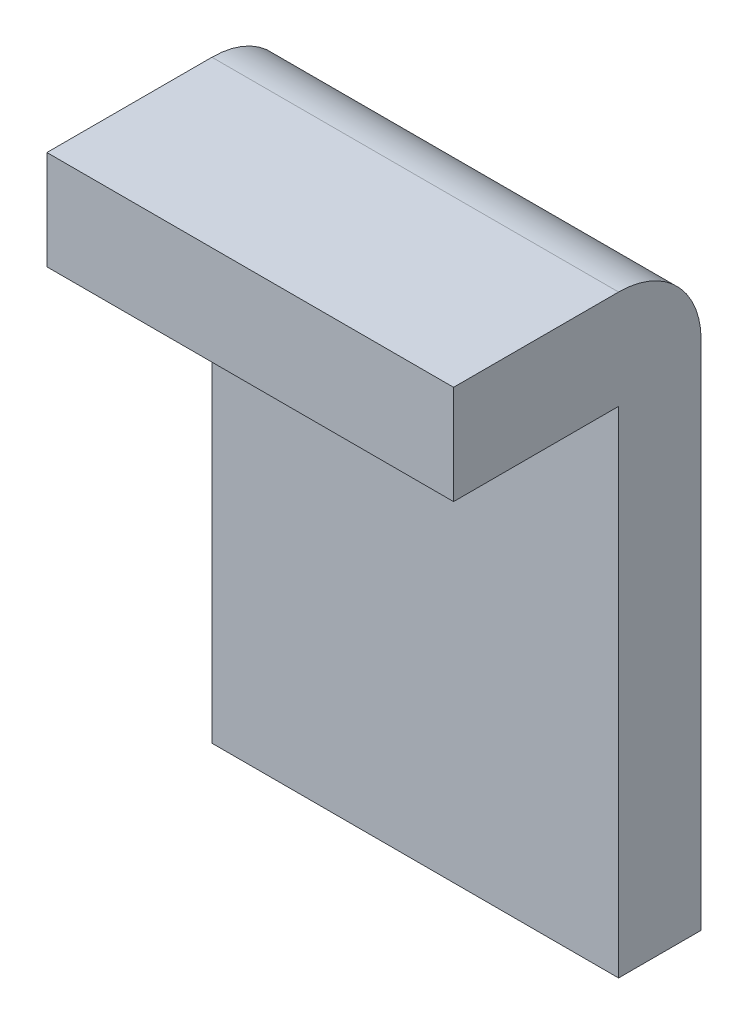
ISO-10303-21;
HEADER;
FILE_DESCRIPTION(('STEP AP214'),'2;1');
FILE_NAME('part.step','',(''),(''),'','','');
FILE_SCHEMA(('AUTOMOTIVE_DESIGN { 1 0 10303 214 1 1 1 1 }'));
ENDSEC;
DATA;
#1=APPLICATION_CONTEXT('core data for automotive mechanical design processes');
#2=APPLICATION_PROTOCOL_DEFINITION('international standard','automotive_design',2000,#1);
#3=PRODUCT_CONTEXT('',#1,'mechanical');
#4=PRODUCT('Part','Part','',(#3));
#5=PRODUCT_RELATED_PRODUCT_CATEGORY('part','',(#4));
#6=PRODUCT_DEFINITION_FORMATION('','',#4);
#7=PRODUCT_DEFINITION_CONTEXT('part definition',#1,'design');
#8=PRODUCT_DEFINITION('design','',#6,#7);
#9=PRODUCT_DEFINITION_SHAPE('','',#8);
#10=(LENGTH_UNIT() NAMED_UNIT(*) SI_UNIT(.MILLI.,.METRE.));
#11=(NAMED_UNIT(*) PLANE_ANGLE_UNIT() SI_UNIT($,.RADIAN.));
#12=(NAMED_UNIT(*) SI_UNIT($,.STERADIAN.) SOLID_ANGLE_UNIT());
#13=UNCERTAINTY_MEASURE_WITH_UNIT(LENGTH_MEASURE(1.E-05),#10,'distance_accuracy_value','');
#14=(GEOMETRIC_REPRESENTATION_CONTEXT(3) GLOBAL_UNCERTAINTY_ASSIGNED_CONTEXT((#13)) GLOBAL_UNIT_ASSIGNED_CONTEXT((#10,
#11,#12)) REPRESENTATION_CONTEXT('',''));
#15=CARTESIAN_POINT('',(0.,0.,0.));
#16=DIRECTION('',(0.,0.,1.));
#17=DIRECTION('',(1.,0.,0.));
#18=AXIS2_PLACEMENT_3D('',#15,#16,#17);
#19=CARTESIAN_POINT('',(-8.34906661620967,8.30000000000001,4.25467377707551));
#20=DIRECTION('',(0.,1.,0.));
#21=DIRECTION('',(0.,0.,1.));
#22=AXIS2_PLACEMENT_3D('',#19,#20,#21);
#23=PLANE('',#22);
#24=DIRECTION('',(1.,0.,0.));
#25=VECTOR('',#24,1.);
#26=CARTESIAN_POINT('',(9.16373951271684,8.30000000000001,4.25467377707552));
#27=LINE('',#26,#25);
#28=CARTESIAN_POINT('',(9.16373951271684,8.30000000000001,4.25467377707551));
#29=VERTEX_POINT('',#28);
#30=CARTESIAN_POINT('',(10.3958902691576,8.30000000000001,4.25467377707551));
#31=VERTEX_POINT('',#30);
#32=EDGE_CURVE('E133',#29,#31,#27,.T.);
#33=ORIENTED_EDGE('',*,*,#32,.F.);
#34=DIRECTION('',(0.,0.,1.));
#35=VECTOR('',#34,1.);
#36=CARTESIAN_POINT('',(9.16373951271684,8.30000000000001,4.25467377707553));
#37=LINE('',#36,#35);
#38=CARTESIAN_POINT('',(9.16373951271684,8.30000000000001,3.75467377707551));
#39=VERTEX_POINT('',#38);
#40=EDGE_CURVE('E113',#39,#29,#37,.T.);
#41=ORIENTED_EDGE('',*,*,#40,.F.);
#42=DIRECTION('',(1.,0.,0.));
#43=VECTOR('',#42,1.);
#44=CARTESIAN_POINT('',(-8.34906661620967,8.30000000000001,3.75467377707551));
#45=LINE('',#44,#43);
#46=CARTESIAN_POINT('',(10.3958902691576,8.30000000000001,3.75467377707551));
#47=VERTEX_POINT('',#46);
#48=EDGE_CURVE('E130',#39,#47,#45,.T.);
#49=ORIENTED_EDGE('',*,*,#48,.T.);
#50=DIRECTION('',(0.,0.,-1.));
#51=VECTOR('',#50,1.);
#52=CARTESIAN_POINT('',(10.3958902691576,8.30000000000001,4.25467377707553));
#53=LINE('',#52,#51);
#54=EDGE_CURVE('E129',#31,#47,#53,.T.);
#55=ORIENTED_EDGE('',*,*,#54,.F.);
#56=EDGE_LOOP('',(#33,#41,#49,#55));
#57=FACE_BOUND('',#56,.T.);
#58=ADVANCED_FACE('F17',(#57),#23,.F.);
#59=CARTESIAN_POINT('',(9.16373951271684,5.35753839337144,4.25467377707553));
#60=DIRECTION('',(0.,0.,1.));
#61=DIRECTION('',(0.,-1.,0.));
#62=AXIS2_PLACEMENT_3D('',#59,#60,#61);
#63=PLANE('',#62);
#64=DIRECTION('',(1.,0.,0.));
#65=VECTOR('',#64,1.);
#66=CARTESIAN_POINT('',(-8.34906661620967,8.6,4.25467377707551));
#67=LINE('',#66,#65);
#68=CARTESIAN_POINT('',(10.3958902691576,8.6,4.25467377707551));
#69=VERTEX_POINT('',#68);
#70=CARTESIAN_POINT('',(9.16373951271684,8.6,4.25467377707551));
#71=VERTEX_POINT('',#70);
#72=EDGE_CURVE('E131',#69,#71,#67,.F.);
#73=ORIENTED_EDGE('',*,*,#72,.T.);
#74=DIRECTION('',(0.,1.,0.));
#75=VECTOR('',#74,1.);
#76=CARTESIAN_POINT('',(9.16373951271684,5.35753839337144,4.25467377707551));
#77=LINE('',#76,#75);
#78=EDGE_CURVE('E136',#29,#71,#77,.T.);
#79=ORIENTED_EDGE('',*,*,#78,.F.);
#80=ORIENTED_EDGE('',*,*,#32,.T.);
#81=DIRECTION('',(0.,1.,0.));
#82=VECTOR('',#81,1.);
#83=CARTESIAN_POINT('',(10.3958902691576,5.35753839337144,4.25467377707551));
#84=LINE('',#83,#82);
#85=EDGE_CURVE('E120',#69,#31,#84,.F.);
#86=ORIENTED_EDGE('',*,*,#85,.F.);
#87=EDGE_LOOP('',(#73,#79,#80,#86));
#88=FACE_BOUND('',#87,.T.);
#89=ADVANCED_FACE('F172',(#88),#63,.T.);
#90=CARTESIAN_POINT('',(-8.34906661620967,8.6,4.25467377707551));
#91=DIRECTION('',(0.,-1.,0.));
#92=DIRECTION('',(0.,0.,-1.));
#93=AXIS2_PLACEMENT_3D('',#90,#91,#92);
#94=PLANE('',#93);
#95=DIRECTION('',(1.,0.,0.));
#96=VECTOR('',#95,1.);
#97=CARTESIAN_POINT('',(-8.34906661620967,8.6,3.75467377707551));
#98=LINE('',#97,#96);
#99=CARTESIAN_POINT('',(9.16373951271684,8.6,3.7546737770755));
#100=VERTEX_POINT('',#99);
#101=CARTESIAN_POINT('',(10.3958902691576,8.6,3.7546737770755));
#102=VERTEX_POINT('',#101);
#103=EDGE_CURVE('E79',#100,#102,#98,.T.);
#104=ORIENTED_EDGE('',*,*,#103,.F.);
#105=DIRECTION('',(0.,0.,1.));
#106=VECTOR('',#105,1.);
#107=CARTESIAN_POINT('',(9.16373951271684,8.6,4.25467377707553));
#108=LINE('',#107,#106);
#109=EDGE_CURVE('E139',#71,#100,#108,.F.);
#110=ORIENTED_EDGE('',*,*,#109,.F.);
#111=ORIENTED_EDGE('',*,*,#72,.F.);
#112=DIRECTION('',(0.,0.,-1.));
#113=VECTOR('',#112,1.);
#114=CARTESIAN_POINT('',(10.3958902691576,8.6,4.25467377707553));
#115=LINE('',#114,#113);
#116=EDGE_CURVE('E83',#102,#69,#115,.F.);
#117=ORIENTED_EDGE('',*,*,#116,.F.);
#118=EDGE_LOOP('',(#104,#110,#111,#117));
#119=FACE_BOUND('',#118,.T.);
#120=ADVANCED_FACE('F169',(#119),#94,.F.);
#121=CARTESIAN_POINT('',(-8.34906661620967,8.30000000000001,3.75467377707551));
#122=DIRECTION('',(0.,0.,-1.));
#123=DIRECTION('',(0.,1.,0.));
#124=AXIS2_PLACEMENT_3D('',#121,#122,#123);
#125=PLANE('',#124);
#126=ORIENTED_EDGE('',*,*,#48,.F.);
#127=DIRECTION('',(0.,1.,0.));
#128=VECTOR('',#127,1.);
#129=CARTESIAN_POINT('',(9.16373951271684,5.35753839337144,3.75467377707551));
#130=LINE('',#129,#128);
#131=CARTESIAN_POINT('',(9.16373951271684,6.8,3.75467377707551));
#132=VERTEX_POINT('',#131);
#133=EDGE_CURVE('E95',#132,#39,#130,.T.);
#134=ORIENTED_EDGE('',*,*,#133,.F.);
#135=DIRECTION('',(1.,0.,0.));
#136=VECTOR('',#135,1.);
#137=CARTESIAN_POINT('',(-15.8147962412963,6.8,3.75467377707551));
#138=LINE('',#137,#136);
#139=CARTESIAN_POINT('',(10.3958902691576,6.8,3.75467377707551));
#140=VERTEX_POINT('',#139);
#141=EDGE_CURVE('E114',#140,#132,#138,.F.);
#142=ORIENTED_EDGE('',*,*,#141,.F.);
#143=DIRECTION('',(0.,1.,0.));
#144=VECTOR('',#143,1.);
#145=CARTESIAN_POINT('',(10.3958902691576,5.35753839337144,3.75467377707551));
#146=LINE('',#145,#144);
#147=EDGE_CURVE('E84',#47,#140,#146,.F.);
#148=ORIENTED_EDGE('',*,*,#147,.F.);
#149=EDGE_LOOP('',(#126,#134,#142,#148));
#150=FACE_BOUND('',#149,.T.);
#151=ADVANCED_FACE('F178',(#150),#125,.F.);
#152=CARTESIAN_POINT('',(-8.34906661620967,8.35,3.7546737770755));
#153=DIRECTION('',(1.,0.,0.));
#154=DIRECTION('',(0.,0.,-1.));
#155=AXIS2_PLACEMENT_3D('',#152,#153,#154);
#156=CYLINDRICAL_SURFACE('',#155,0.249999999999996);
#157=CARTESIAN_POINT('',(9.16373951271684,8.35,3.7546737770755));
#158=DIRECTION('',(1.,0.,0.));
#159=DIRECTION('',(0.,0.,-1.));
#160=AXIS2_PLACEMENT_3D('',#157,#158,#159);
#161=CIRCLE('',#160,0.249999999999996);
#162=CARTESIAN_POINT('',(9.16373951271684,8.35,3.50467377707551));
#163=VERTEX_POINT('',#162);
#164=EDGE_CURVE('E106',#100,#163,#161,.F.);
#165=ORIENTED_EDGE('',*,*,#164,.F.);
#166=ORIENTED_EDGE('',*,*,#103,.T.);
#167=CARTESIAN_POINT('',(10.3958902691576,8.35,3.7546737770755));
#168=DIRECTION('',(1.,0.,0.));
#169=DIRECTION('',(0.,0.,-1.));
#170=AXIS2_PLACEMENT_3D('',#167,#168,#169);
#171=CIRCLE('',#170,0.249999999999996);
#172=CARTESIAN_POINT('',(10.3958902691576,8.35,3.50467377707551));
#173=VERTEX_POINT('',#172);
#174=EDGE_CURVE('E20',#173,#102,#171,.T.);
#175=ORIENTED_EDGE('',*,*,#174,.F.);
#176=DIRECTION('',(1.,0.,0.));
#177=VECTOR('',#176,1.);
#178=CARTESIAN_POINT('',(9.16373951271684,8.35,3.50467377707551));
#179=LINE('',#178,#177);
#180=EDGE_CURVE('E77',#163,#173,#179,.T.);
#181=ORIENTED_EDGE('',*,*,#180,.F.);
#182=EDGE_LOOP('',(#165,#166,#175,#181));
#183=FACE_BOUND('',#182,.T.);
#184=ADVANCED_FACE('F75',(#183),#156,.T.);
#185=CARTESIAN_POINT('',(10.3958902691576,5.35753839337144,4.25467377707553));
#186=DIRECTION('',(1.,0.,0.));
#187=DIRECTION('',(0.,0.,-1.));
#188=AXIS2_PLACEMENT_3D('',#185,#186,#187);
#189=PLANE('',#188);
#190=ORIENTED_EDGE('',*,*,#116,.T.);
#191=ORIENTED_EDGE('',*,*,#85,.T.);
#192=ORIENTED_EDGE('',*,*,#54,.T.);
#193=ORIENTED_EDGE('',*,*,#147,.T.);
#194=DIRECTION('',(0.,0.,-1.));
#195=VECTOR('',#194,1.);
#196=CARTESIAN_POINT('',(10.3958902691576,6.80000000000003,12.5046737770755));
#197=LINE('',#196,#195);
#198=CARTESIAN_POINT('',(10.3958902691576,6.8,3.50467377707552));
#199=VERTEX_POINT('',#198);
#200=EDGE_CURVE('E90',#199,#140,#197,.F.);
#201=ORIENTED_EDGE('',*,*,#200,.F.);
#202=DIRECTION('',(0.,1.,0.));
#203=VECTOR('',#202,1.);
#204=CARTESIAN_POINT('',(10.3958902691576,5.35753839337143,3.50467377707553));
#205=LINE('',#204,#203);
#206=EDGE_CURVE('E86',#173,#199,#205,.F.);
#207=ORIENTED_EDGE('',*,*,#206,.F.);
#208=ORIENTED_EDGE('',*,*,#174,.T.);
#209=EDGE_LOOP('',(#190,#191,#192,#193,#201,#207,#208));
#210=FACE_BOUND('',#209,.T.);
#211=ADVANCED_FACE('F87',(#210),#189,.T.);
#212=CARTESIAN_POINT('',(-15.8147962412963,6.80000000000003,12.5046737770755));
#213=DIRECTION('',(0.,-1.,0.));
#214=DIRECTION('',(0.,0.,-1.));
#215=AXIS2_PLACEMENT_3D('',#212,#213,#214);
#216=PLANE('',#215);
#217=DIRECTION('',(1.,0.,0.));
#218=VECTOR('',#217,1.);
#219=CARTESIAN_POINT('',(9.16373951271684,6.8,3.50467377707552));
#220=LINE('',#219,#218);
#221=CARTESIAN_POINT('',(9.16373951271684,6.8,3.50467377707552));
#222=VERTEX_POINT('',#221);
#223=EDGE_CURVE('E26',#199,#222,#220,.F.);
#224=ORIENTED_EDGE('',*,*,#223,.F.);
#225=ORIENTED_EDGE('',*,*,#200,.T.);
#226=ORIENTED_EDGE('',*,*,#141,.T.);
#227=DIRECTION('',(0.,0.,1.));
#228=VECTOR('',#227,1.);
#229=CARTESIAN_POINT('',(9.16373951271684,6.8,4.25467377707553));
#230=LINE('',#229,#228);
#231=EDGE_CURVE('E35',#222,#132,#230,.T.);
#232=ORIENTED_EDGE('',*,*,#231,.F.);
#233=EDGE_LOOP('',(#224,#225,#226,#232));
#234=FACE_BOUND('',#233,.T.);
#235=ADVANCED_FACE('F179',(#234),#216,.T.);
#236=CARTESIAN_POINT('',(9.16373951271684,5.35753839337144,4.25467377707553));
#237=DIRECTION('',(-1.,0.,0.));
#238=DIRECTION('',(0.,0.,1.));
#239=AXIS2_PLACEMENT_3D('',#236,#237,#238);
#240=PLANE('',#239);
#241=ORIENTED_EDGE('',*,*,#231,.T.);
#242=ORIENTED_EDGE('',*,*,#133,.T.);
#243=ORIENTED_EDGE('',*,*,#40,.T.);
#244=ORIENTED_EDGE('',*,*,#78,.T.);
#245=ORIENTED_EDGE('',*,*,#109,.T.);
#246=ORIENTED_EDGE('',*,*,#164,.T.);
#247=DIRECTION('',(0.,1.,0.));
#248=VECTOR('',#247,1.);
#249=CARTESIAN_POINT('',(9.16373951271684,5.35753839337143,3.50467377707553));
#250=LINE('',#249,#248);
#251=EDGE_CURVE('E11',#222,#163,#250,.T.);
#252=ORIENTED_EDGE('',*,*,#251,.F.);
#253=EDGE_LOOP('',(#241,#242,#243,#244,#245,#246,#252));
#254=FACE_BOUND('',#253,.T.);
#255=ADVANCED_FACE('F166',(#254),#240,.T.);
#256=CARTESIAN_POINT('',(9.16373951271684,5.35753839337143,3.50467377707553));
#257=DIRECTION('',(0.,0.,-1.));
#258=DIRECTION('',(0.,1.,0.));
#259=AXIS2_PLACEMENT_3D('',#256,#257,#258);
#260=PLANE('',#259);
#261=ORIENTED_EDGE('',*,*,#223,.T.);
#262=ORIENTED_EDGE('',*,*,#251,.T.);
#263=ORIENTED_EDGE('',*,*,#180,.T.);
#264=ORIENTED_EDGE('',*,*,#206,.T.);
#265=EDGE_LOOP('',(#261,#262,#263,#264));
#266=FACE_BOUND('',#265,.T.);
#267=ADVANCED_FACE('F94',(#266),#260,.T.);
#268=CLOSED_SHELL('',(#58,#89,#120,#151,#184,#211,#235,#255,#267));
#269=MANIFOLD_SOLID_BREP('B1',#268);
#270=ADVANCED_BREP_SHAPE_REPRESENTATION('',(#18,#269),#14);
#271=SHAPE_DEFINITION_REPRESENTATION(#9,#270);
ENDSEC;
END-ISO-10303-21;
